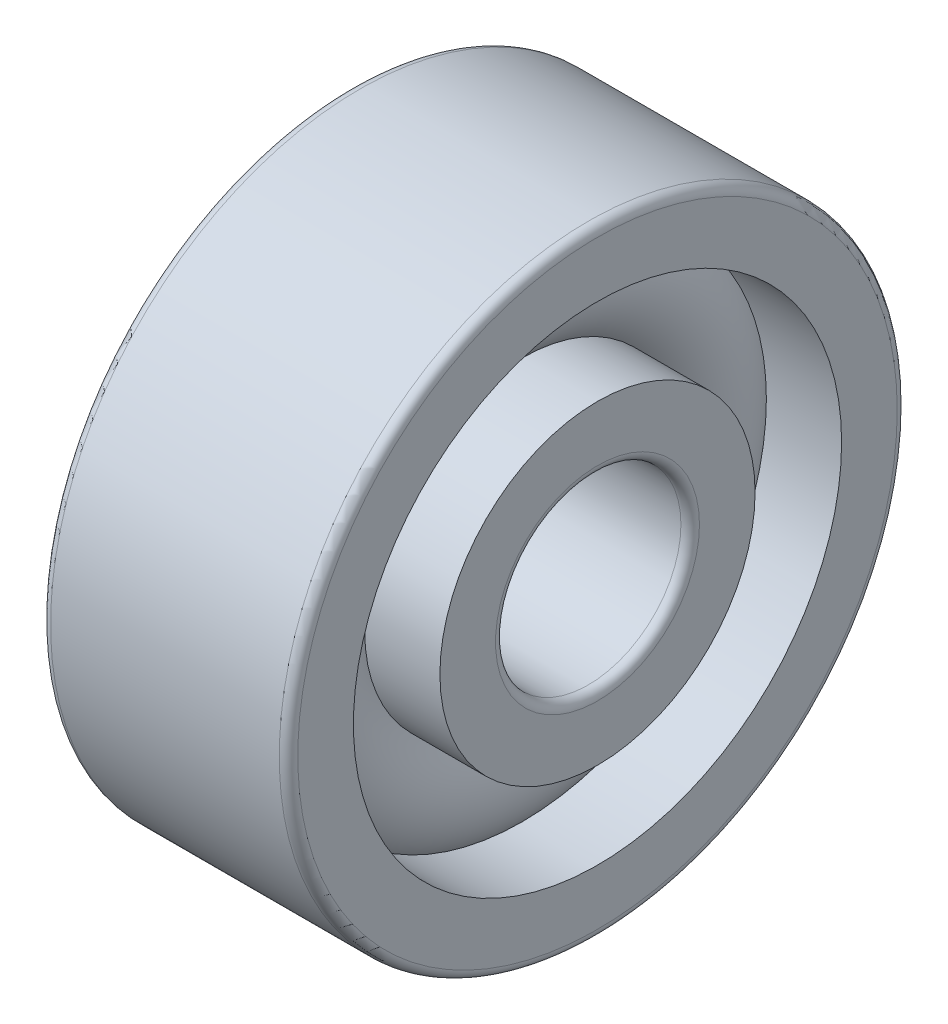
ISO-10303-21;
HEADER;
FILE_DESCRIPTION(('STEP AP214'),'2;1');
FILE_NAME('part.step','',(''),(''),'','','');
FILE_SCHEMA(('AUTOMOTIVE_DESIGN { 1 0 10303 214 1 1 1 1 }'));
ENDSEC;
DATA;
#1=APPLICATION_CONTEXT('core data for automotive mechanical design processes');
#2=APPLICATION_PROTOCOL_DEFINITION('international standard','automotive_design',2000,#1);
#3=PRODUCT_CONTEXT('',#1,'mechanical');
#4=PRODUCT('Part','Part','',(#3));
#5=PRODUCT_RELATED_PRODUCT_CATEGORY('part','',(#4));
#6=PRODUCT_DEFINITION_FORMATION('','',#4);
#7=PRODUCT_DEFINITION_CONTEXT('part definition',#1,'design');
#8=PRODUCT_DEFINITION('design','',#6,#7);
#9=PRODUCT_DEFINITION_SHAPE('','',#8);
#10=(LENGTH_UNIT() NAMED_UNIT(*) SI_UNIT(.MILLI.,.METRE.));
#11=(NAMED_UNIT(*) PLANE_ANGLE_UNIT() SI_UNIT($,.RADIAN.));
#12=(NAMED_UNIT(*) SI_UNIT($,.STERADIAN.) SOLID_ANGLE_UNIT());
#13=UNCERTAINTY_MEASURE_WITH_UNIT(LENGTH_MEASURE(1.E-05),#10,'distance_accuracy_value','');
#14=(GEOMETRIC_REPRESENTATION_CONTEXT(3) GLOBAL_UNCERTAINTY_ASSIGNED_CONTEXT((#13)) GLOBAL_UNIT_ASSIGNED_CONTEXT((#10,
#11,#12)) REPRESENTATION_CONTEXT('',''));
#15=CARTESIAN_POINT('',(0.,0.,0.));
#16=DIRECTION('',(0.,0.,1.));
#17=DIRECTION('',(1.,0.,0.));
#18=AXIS2_PLACEMENT_3D('',#15,#16,#17);
#19=CARTESIAN_POINT('',(0.,0.,0.));
#20=DIRECTION('',(-1.,0.,0.));
#21=DIRECTION('',(0.,0.,1.));
#22=AXIS2_PLACEMENT_3D('',#19,#20,#21);
#23=TOROIDAL_SURFACE('',#22,3.25,1.05);
#24=CARTESIAN_POINT('',(0.782623792124922,0.,0.));
#25=DIRECTION('',(-1.,0.,0.));
#26=DIRECTION('',(0.,0.,1.));
#27=AXIS2_PLACEMENT_3D('',#24,#25,#26);
#28=CIRCLE('',#27,3.95);
#29=CARTESIAN_POINT('',(0.782623792124922,0.,3.95));
#30=VERTEX_POINT('',#29);
#31=EDGE_CURVE('E35',#30,#30,#28,.F.);
#32=ORIENTED_EDGE('',*,*,#31,.T.);
#33=EDGE_LOOP('',(#32));
#34=FACE_BOUND('',#33,.T.);
#35=CARTESIAN_POINT('',(0.782623792124926,0.,0.));
#36=DIRECTION('',(-1.,0.,0.));
#37=DIRECTION('',(0.,0.,1.));
#38=AXIS2_PLACEMENT_3D('',#35,#36,#37);
#39=CIRCLE('',#38,2.55);
#40=CARTESIAN_POINT('',(0.782623792124926,0.,2.55));
#41=VERTEX_POINT('',#40);
#42=EDGE_CURVE('E10',#41,#41,#39,.T.);
#43=ORIENTED_EDGE('',*,*,#42,.T.);
#44=EDGE_LOOP('',(#43));
#45=FACE_BOUND('',#44,.T.);
#46=ADVANCED_FACE('F31',(#34,#45),#23,.T.);
#47=CARTESIAN_POINT('',(-20.6375,0.,0.));
#48=DIRECTION('',(1.,0.,0.));
#49=DIRECTION('',(0.,0.,-1.));
#50=AXIS2_PLACEMENT_3D('',#47,#48,#49);
#51=CYLINDRICAL_SURFACE('',#50,2.55);
#52=CARTESIAN_POINT('',(2.,0.,0.));
#53=DIRECTION('',(1.,0.,0.));
#54=DIRECTION('',(0.,0.,-1.));
#55=AXIS2_PLACEMENT_3D('',#52,#53,#54);
#56=CIRCLE('',#55,2.55);
#57=CARTESIAN_POINT('',(2.,0.,-2.55));
#58=VERTEX_POINT('',#57);
#59=EDGE_CURVE('E44',#58,#58,#56,.T.);
#60=ORIENTED_EDGE('',*,*,#59,.F.);
#61=EDGE_LOOP('',(#60));
#62=FACE_BOUND('',#61,.T.);
#63=ORIENTED_EDGE('',*,*,#42,.F.);
#64=EDGE_LOOP('',(#63));
#65=FACE_BOUND('',#64,.T.);
#66=ADVANCED_FACE('F83',(#62,#65),#51,.T.);
#67=CARTESIAN_POINT('',(-20.6375,0.,0.));
#68=DIRECTION('',(1.,0.,0.));
#69=DIRECTION('',(0.,0.,-1.));
#70=AXIS2_PLACEMENT_3D('',#67,#68,#69);
#71=CYLINDRICAL_SURFACE('',#70,2.55);
#72=CARTESIAN_POINT('',(-2.,0.,0.));
#73=DIRECTION('',(1.,0.,0.));
#74=DIRECTION('',(0.,0.,-1.));
#75=AXIS2_PLACEMENT_3D('',#72,#73,#74);
#76=CIRCLE('',#75,2.55);
#77=CARTESIAN_POINT('',(-2.,0.,-2.55));
#78=VERTEX_POINT('',#77);
#79=EDGE_CURVE('E53',#78,#78,#76,.T.);
#80=ORIENTED_EDGE('',*,*,#79,.T.);
#81=EDGE_LOOP('',(#80));
#82=FACE_BOUND('',#81,.T.);
#83=CARTESIAN_POINT('',(-0.782623792124926,0.,0.));
#84=DIRECTION('',(1.,0.,0.));
#85=DIRECTION('',(0.,0.,-1.));
#86=AXIS2_PLACEMENT_3D('',#83,#84,#85);
#87=CIRCLE('',#86,2.55);
#88=CARTESIAN_POINT('',(-0.782623792124926,0.,-2.55));
#89=VERTEX_POINT('',#88);
#90=EDGE_CURVE('E39',#89,#89,#87,.T.);
#91=ORIENTED_EDGE('',*,*,#90,.F.);
#92=EDGE_LOOP('',(#91));
#93=FACE_BOUND('',#92,.T.);
#94=ADVANCED_FACE('F86',(#82,#93),#71,.T.);
#95=CARTESIAN_POINT('',(2.,1.65,0.));
#96=DIRECTION('',(1.,0.,0.));
#97=DIRECTION('',(0.,0.,-1.));
#98=AXIS2_PLACEMENT_3D('',#95,#96,#97);
#99=PLANE('',#98);
#100=ORIENTED_EDGE('',*,*,#59,.T.);
#101=EDGE_LOOP('',(#100));
#102=FACE_BOUND('',#101,.T.);
#103=CARTESIAN_POINT('',(2.,0.,0.));
#104=DIRECTION('',(1.,0.,0.));
#105=DIRECTION('',(0.,0.,-1.));
#106=AXIS2_PLACEMENT_3D('',#103,#104,#105);
#107=CIRCLE('',#106,1.65);
#108=CARTESIAN_POINT('',(2.,0.,-1.65));
#109=VERTEX_POINT('',#108);
#110=EDGE_CURVE('E75',#109,#109,#107,.T.);
#111=ORIENTED_EDGE('',*,*,#110,.F.);
#112=EDGE_LOOP('',(#111));
#113=FACE_BOUND('',#112,.T.);
#114=ADVANCED_FACE('F80',(#102,#113),#99,.T.);
#115=CARTESIAN_POINT('',(1.85,0.,0.));
#116=DIRECTION('',(1.,0.,0.));
#117=DIRECTION('',(0.,0.,-1.));
#118=AXIS2_PLACEMENT_3D('',#115,#116,#117);
#119=TOROIDAL_SURFACE('',#118,1.65,0.15);
#120=ORIENTED_EDGE('',*,*,#110,.T.);
#121=EDGE_LOOP('',(#120));
#122=FACE_BOUND('',#121,.T.);
#123=CARTESIAN_POINT('',(1.85,0.,0.));
#124=DIRECTION('',(1.,0.,0.));
#125=DIRECTION('',(0.,0.,-1.));
#126=AXIS2_PLACEMENT_3D('',#123,#124,#125);
#127=CIRCLE('',#126,1.5);
#128=CARTESIAN_POINT('',(1.85,0.,-1.5));
#129=VERTEX_POINT('',#128);
#130=EDGE_CURVE('E72',#129,#129,#127,.T.);
#131=ORIENTED_EDGE('',*,*,#130,.F.);
#132=EDGE_LOOP('',(#131));
#133=FACE_BOUND('',#132,.T.);
#134=ADVANCED_FACE('F97',(#122,#133),#119,.T.);
#135=CARTESIAN_POINT('',(-20.6375,0.,0.));
#136=DIRECTION('',(1.,0.,0.));
#137=DIRECTION('',(0.,0.,-1.));
#138=AXIS2_PLACEMENT_3D('',#135,#136,#137);
#139=CYLINDRICAL_SURFACE('',#138,1.5);
#140=ORIENTED_EDGE('',*,*,#130,.T.);
#141=EDGE_LOOP('',(#140));
#142=FACE_BOUND('',#141,.T.);
#143=CARTESIAN_POINT('',(-1.85,0.,0.));
#144=DIRECTION('',(1.,0.,0.));
#145=DIRECTION('',(0.,0.,-1.));
#146=AXIS2_PLACEMENT_3D('',#143,#144,#145);
#147=CIRCLE('',#146,1.5);
#148=CARTESIAN_POINT('',(-1.85,0.,-1.5));
#149=VERTEX_POINT('',#148);
#150=EDGE_CURVE('E69',#149,#149,#147,.T.);
#151=ORIENTED_EDGE('',*,*,#150,.F.);
#152=EDGE_LOOP('',(#151));
#153=FACE_BOUND('',#152,.T.);
#154=ADVANCED_FACE('F100',(#142,#153),#139,.F.);
#155=CARTESIAN_POINT('',(-1.85,0.,0.));
#156=DIRECTION('',(1.,0.,0.));
#157=DIRECTION('',(0.,0.,-1.));
#158=AXIS2_PLACEMENT_3D('',#155,#156,#157);
#159=TOROIDAL_SURFACE('',#158,1.65,0.15);
#160=ORIENTED_EDGE('',*,*,#150,.T.);
#161=EDGE_LOOP('',(#160));
#162=FACE_BOUND('',#161,.T.);
#163=CARTESIAN_POINT('',(-2.,0.,0.));
#164=DIRECTION('',(1.,0.,0.));
#165=DIRECTION('',(0.,0.,-1.));
#166=AXIS2_PLACEMENT_3D('',#163,#164,#165);
#167=CIRCLE('',#166,1.65);
#168=CARTESIAN_POINT('',(-2.,0.,-1.65));
#169=VERTEX_POINT('',#168);
#170=EDGE_CURVE('E66',#169,#169,#167,.T.);
#171=ORIENTED_EDGE('',*,*,#170,.F.);
#172=EDGE_LOOP('',(#171));
#173=FACE_BOUND('',#172,.T.);
#174=ADVANCED_FACE('F104',(#162,#173),#159,.T.);
#175=CARTESIAN_POINT('',(-2.,2.55,0.));
#176=DIRECTION('',(-1.,0.,0.));
#177=DIRECTION('',(0.,0.,1.));
#178=AXIS2_PLACEMENT_3D('',#175,#176,#177);
#179=PLANE('',#178);
#180=ORIENTED_EDGE('',*,*,#170,.T.);
#181=EDGE_LOOP('',(#180));
#182=FACE_BOUND('',#181,.T.);
#183=ORIENTED_EDGE('',*,*,#79,.F.);
#184=EDGE_LOOP('',(#183));
#185=FACE_BOUND('',#184,.T.);
#186=ADVANCED_FACE('F108',(#182,#185),#179,.T.);
#187=CARTESIAN_POINT('',(-0.782623792124922,0.,0.));
#188=DIRECTION('',(1.,0.,0.));
#189=DIRECTION('',(0.,0.,-1.));
#190=AXIS2_PLACEMENT_3D('',#187,#188,#189);
#191=CIRCLE('',#190,3.95);
#192=CARTESIAN_POINT('',(-0.782623792124922,0.,-3.95));
#193=VERTEX_POINT('',#192);
#194=EDGE_CURVE('E47',#193,#193,#191,.F.);
#195=ORIENTED_EDGE('',*,*,#194,.T.);
#196=EDGE_LOOP('',(#195));
#197=FACE_BOUND('',#196,.T.);
#198=ORIENTED_EDGE('',*,*,#90,.T.);
#199=EDGE_LOOP('',(#198));
#200=FACE_BOUND('',#199,.T.);
#201=ADVANCED_FACE('F33',(#197,#200),#23,.T.);
#202=CARTESIAN_POINT('',(-20.6375,0.,0.));
#203=DIRECTION('',(1.,0.,0.));
#204=DIRECTION('',(0.,0.,-1.));
#205=AXIS2_PLACEMENT_3D('',#202,#203,#204);
#206=CYLINDRICAL_SURFACE('',#205,3.95);
#207=CARTESIAN_POINT('',(2.,0.,0.));
#208=DIRECTION('',(1.,0.,0.));
#209=DIRECTION('',(0.,0.,-1.));
#210=AXIS2_PLACEMENT_3D('',#207,#208,#209);
#211=CIRCLE('',#210,3.95000000000001);
#212=CARTESIAN_POINT('',(2.,0.,-3.95000000000001));
#213=VERTEX_POINT('',#212);
#214=EDGE_CURVE('E49',#213,#213,#211,.T.);
#215=ORIENTED_EDGE('',*,*,#214,.T.);
#216=EDGE_LOOP('',(#215));
#217=FACE_BOUND('',#216,.T.);
#218=ORIENTED_EDGE('',*,*,#31,.F.);
#219=EDGE_LOOP('',(#218));
#220=FACE_BOUND('',#219,.T.);
#221=ADVANCED_FACE('F113',(#217,#220),#206,.F.);
#222=CARTESIAN_POINT('',(-20.6375,0.,0.));
#223=DIRECTION('',(1.,0.,0.));
#224=DIRECTION('',(0.,0.,-1.));
#225=AXIS2_PLACEMENT_3D('',#222,#223,#224);
#226=CYLINDRICAL_SURFACE('',#225,3.95);
#227=CARTESIAN_POINT('',(-2.,0.,0.));
#228=DIRECTION('',(1.,0.,0.));
#229=DIRECTION('',(0.,0.,-1.));
#230=AXIS2_PLACEMENT_3D('',#227,#228,#229);
#231=CIRCLE('',#230,3.95000000000001);
#232=CARTESIAN_POINT('',(-2.,0.,-3.95000000000001));
#233=VERTEX_POINT('',#232);
#234=EDGE_CURVE('E144',#233,#233,#231,.T.);
#235=ORIENTED_EDGE('',*,*,#234,.F.);
#236=EDGE_LOOP('',(#235));
#237=FACE_BOUND('',#236,.T.);
#238=ORIENTED_EDGE('',*,*,#194,.F.);
#239=EDGE_LOOP('',(#238));
#240=FACE_BOUND('',#239,.T.);
#241=ADVANCED_FACE('F116',(#237,#240),#226,.F.);
#242=CARTESIAN_POINT('',(2.,4.85,0.));
#243=DIRECTION('',(1.,0.,0.));
#244=DIRECTION('',(0.,0.,-1.));
#245=AXIS2_PLACEMENT_3D('',#242,#243,#244);
#246=PLANE('',#245);
#247=CARTESIAN_POINT('',(2.,0.,0.));
#248=DIRECTION('',(1.,0.,0.));
#249=DIRECTION('',(0.,0.,-1.));
#250=AXIS2_PLACEMENT_3D('',#247,#248,#249);
#251=CIRCLE('',#250,4.85);
#252=CARTESIAN_POINT('',(2.,0.,-4.85));
#253=VERTEX_POINT('',#252);
#254=EDGE_CURVE('E55',#253,#253,#251,.T.);
#255=ORIENTED_EDGE('',*,*,#254,.T.);
#256=EDGE_LOOP('',(#255));
#257=FACE_BOUND('',#256,.T.);
#258=ORIENTED_EDGE('',*,*,#214,.F.);
#259=EDGE_LOOP('',(#258));
#260=FACE_BOUND('',#259,.T.);
#261=ADVANCED_FACE('F117',(#257,#260),#246,.T.);
#262=CARTESIAN_POINT('',(1.85,0.,0.));
#263=DIRECTION('',(1.,0.,0.));
#264=DIRECTION('',(0.,0.,-1.));
#265=AXIS2_PLACEMENT_3D('',#262,#263,#264);
#266=TOROIDAL_SURFACE('',#265,4.85,0.15);
#267=CARTESIAN_POINT('',(1.85,0.,0.));
#268=DIRECTION('',(1.,0.,0.));
#269=DIRECTION('',(0.,0.,-1.));
#270=AXIS2_PLACEMENT_3D('',#267,#268,#269);
#271=CIRCLE('',#270,5.00000000000001);
#272=CARTESIAN_POINT('',(1.85,0.,-5.00000000000001));
#273=VERTEX_POINT('',#272);
#274=EDGE_CURVE('E60',#273,#273,#271,.T.);
#275=ORIENTED_EDGE('',*,*,#274,.T.);
#276=EDGE_LOOP('',(#275));
#277=FACE_BOUND('',#276,.T.);
#278=ORIENTED_EDGE('',*,*,#254,.F.);
#279=EDGE_LOOP('',(#278));
#280=FACE_BOUND('',#279,.T.);
#281=ADVANCED_FACE('F120',(#277,#280),#266,.T.);
#282=CARTESIAN_POINT('',(-20.6375,0.,0.));
#283=DIRECTION('',(1.,0.,0.));
#284=DIRECTION('',(0.,0.,-1.));
#285=AXIS2_PLACEMENT_3D('',#282,#283,#284);
#286=CYLINDRICAL_SURFACE('',#285,5.00000000000001);
#287=CARTESIAN_POINT('',(-1.85,0.,0.));
#288=DIRECTION('',(1.,0.,0.));
#289=DIRECTION('',(0.,0.,-1.));
#290=AXIS2_PLACEMENT_3D('',#287,#288,#289);
#291=CIRCLE('',#290,5.00000000000001);
#292=CARTESIAN_POINT('',(-1.85,0.,-5.00000000000001));
#293=VERTEX_POINT('',#292);
#294=EDGE_CURVE('E148',#293,#293,#291,.T.);
#295=ORIENTED_EDGE('',*,*,#294,.T.);
#296=EDGE_LOOP('',(#295));
#297=FACE_BOUND('',#296,.T.);
#298=ORIENTED_EDGE('',*,*,#274,.F.);
#299=EDGE_LOOP('',(#298));
#300=FACE_BOUND('',#299,.T.);
#301=ADVANCED_FACE('F124',(#297,#300),#286,.T.);
#302=CARTESIAN_POINT('',(-1.85,0.,0.));
#303=DIRECTION('',(1.,0.,0.));
#304=DIRECTION('',(0.,0.,-1.));
#305=AXIS2_PLACEMENT_3D('',#302,#303,#304);
#306=TOROIDAL_SURFACE('',#305,4.85,0.15);
#307=CARTESIAN_POINT('',(-2.,0.,0.));
#308=DIRECTION('',(1.,0.,0.));
#309=DIRECTION('',(0.,0.,-1.));
#310=AXIS2_PLACEMENT_3D('',#307,#308,#309);
#311=CIRCLE('',#310,4.85);
#312=CARTESIAN_POINT('',(-2.,0.,-4.85));
#313=VERTEX_POINT('',#312);
#314=EDGE_CURVE('E145',#313,#313,#311,.T.);
#315=ORIENTED_EDGE('',*,*,#314,.T.);
#316=EDGE_LOOP('',(#315));
#317=FACE_BOUND('',#316,.T.);
#318=ORIENTED_EDGE('',*,*,#294,.F.);
#319=EDGE_LOOP('',(#318));
#320=FACE_BOUND('',#319,.T.);
#321=ADVANCED_FACE('F128',(#317,#320),#306,.T.);
#322=CARTESIAN_POINT('',(-2.,3.95000000000001,0.));
#323=DIRECTION('',(-1.,0.,0.));
#324=DIRECTION('',(0.,0.,1.));
#325=AXIS2_PLACEMENT_3D('',#322,#323,#324);
#326=PLANE('',#325);
#327=ORIENTED_EDGE('',*,*,#234,.T.);
#328=EDGE_LOOP('',(#327));
#329=FACE_BOUND('',#328,.T.);
#330=ORIENTED_EDGE('',*,*,#314,.F.);
#331=EDGE_LOOP('',(#330));
#332=FACE_BOUND('',#331,.T.);
#333=ADVANCED_FACE('F132',(#329,#332),#326,.T.);
#334=CLOSED_SHELL('',(#46,#66,#94,#114,#134,#154,#174,#186,#201,#221,#241,#261,#281,#301,#321,#333));
#335=MANIFOLD_SOLID_BREP('B2',#334);
#336=ADVANCED_BREP_SHAPE_REPRESENTATION('',(#18,#335),#14);
#337=SHAPE_DEFINITION_REPRESENTATION(#9,#336);
ENDSEC;
END-ISO-10303-21;
